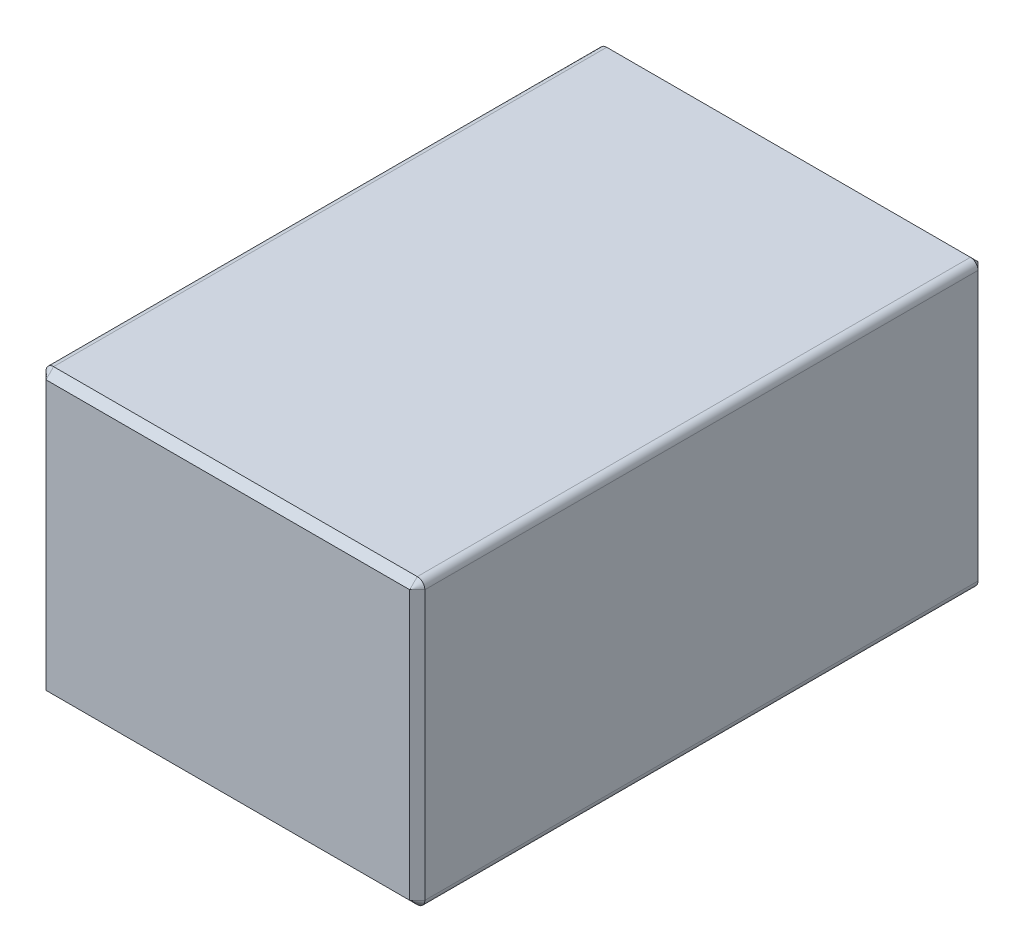
ISO-10303-21;
HEADER;
FILE_DESCRIPTION(('STEP AP214'),'2;1');
FILE_NAME('part.step','',(''),(''),'','','');
FILE_SCHEMA(('AUTOMOTIVE_DESIGN { 1 0 10303 214 1 1 1 1 }'));
ENDSEC;
DATA;
#1=APPLICATION_CONTEXT('core data for automotive mechanical design processes');
#2=APPLICATION_PROTOCOL_DEFINITION('international standard','automotive_design',2000,#1);
#3=PRODUCT_CONTEXT('',#1,'mechanical');
#4=PRODUCT('Part','Part','',(#3));
#5=PRODUCT_RELATED_PRODUCT_CATEGORY('part','',(#4));
#6=PRODUCT_DEFINITION_FORMATION('','',#4);
#7=PRODUCT_DEFINITION_CONTEXT('part definition',#1,'design');
#8=PRODUCT_DEFINITION('design','',#6,#7);
#9=PRODUCT_DEFINITION_SHAPE('','',#8);
#10=(LENGTH_UNIT() NAMED_UNIT(*) SI_UNIT(.MILLI.,.METRE.));
#11=(NAMED_UNIT(*) PLANE_ANGLE_UNIT() SI_UNIT($,.RADIAN.));
#12=(NAMED_UNIT(*) SI_UNIT($,.STERADIAN.) SOLID_ANGLE_UNIT());
#13=UNCERTAINTY_MEASURE_WITH_UNIT(LENGTH_MEASURE(1.E-05),#10,'distance_accuracy_value','');
#14=(GEOMETRIC_REPRESENTATION_CONTEXT(3) GLOBAL_UNCERTAINTY_ASSIGNED_CONTEXT((#13)) GLOBAL_UNIT_ASSIGNED_CONTEXT((#10,
#11,#12)) REPRESENTATION_CONTEXT('',''));
#15=CARTESIAN_POINT('',(0.,0.,0.));
#16=DIRECTION('',(0.,0.,1.));
#17=DIRECTION('',(1.,0.,0.));
#18=AXIS2_PLACEMENT_3D('',#15,#16,#17);
#19=CARTESIAN_POINT('',(50.,75.,-75.));
#20=DIRECTION('',(-1.,0.,0.));
#21=DIRECTION('',(0.,0.,1.));
#22=AXIS2_PLACEMENT_3D('',#19,#20,#21);
#23=PLANE('',#22);
#24=DIRECTION('',(0.,0.,-1.));
#25=VECTOR('',#24,1.);
#26=CARTESIAN_POINT('',(50.,2.,-75.));
#27=LINE('',#26,#25);
#28=CARTESIAN_POINT('',(50.,2.,73.));
#29=VERTEX_POINT('',#28);
#30=CARTESIAN_POINT('',(50.,2.,-73.));
#31=VERTEX_POINT('',#30);
#32=EDGE_CURVE('E251',#29,#31,#27,.T.);
#33=ORIENTED_EDGE('',*,*,#32,.T.);
#34=DIRECTION('',(0.,1.,0.));
#35=VECTOR('',#34,1.);
#36=CARTESIAN_POINT('',(50.,75.,-73.));
#37=LINE('',#36,#35);
#38=CARTESIAN_POINT('',(50.,73.,-73.));
#39=VERTEX_POINT('',#38);
#40=EDGE_CURVE('E233',#31,#39,#37,.T.);
#41=ORIENTED_EDGE('',*,*,#40,.T.);
#42=DIRECTION('',(0.,0.,-1.));
#43=VECTOR('',#42,1.);
#44=CARTESIAN_POINT('',(50.,73.,75.));
#45=LINE('',#44,#43);
#46=CARTESIAN_POINT('',(50.,73.,73.));
#47=VERTEX_POINT('',#46);
#48=EDGE_CURVE('E253',#39,#47,#45,.F.);
#49=ORIENTED_EDGE('',*,*,#48,.T.);
#50=DIRECTION('',(0.,-1.,0.));
#51=VECTOR('',#50,1.);
#52=CARTESIAN_POINT('',(50.,75.,73.));
#53=LINE('',#52,#51);
#54=EDGE_CURVE('E235',#47,#29,#53,.T.);
#55=ORIENTED_EDGE('',*,*,#54,.T.);
#56=EDGE_LOOP('',(#33,#41,#49,#55));
#57=FACE_BOUND('',#56,.T.);
#58=ADVANCED_FACE('F33',(#57),#23,.F.);
#59=CARTESIAN_POINT('',(-50.,75.,-75.));
#60=DIRECTION('',(0.,0.,1.));
#61=DIRECTION('',(1.,0.,0.));
#62=AXIS2_PLACEMENT_3D('',#59,#60,#61);
#63=PLANE('',#62);
#64=DIRECTION('',(1.,0.,0.));
#65=VECTOR('',#64,1.);
#66=CARTESIAN_POINT('',(48.,73.,-75.));
#67=LINE('',#66,#65);
#68=CARTESIAN_POINT('',(-48.,73.,-75.));
#69=VERTEX_POINT('',#68);
#70=CARTESIAN_POINT('',(48.,73.,-75.));
#71=VERTEX_POINT('',#70);
#72=EDGE_CURVE('E239',#69,#71,#67,.T.);
#73=ORIENTED_EDGE('',*,*,#72,.T.);
#74=DIRECTION('',(0.,-1.,0.));
#75=VECTOR('',#74,1.);
#76=CARTESIAN_POINT('',(48.,75.,-75.));
#77=LINE('',#76,#75);
#78=CARTESIAN_POINT('',(48.,2.00000000000003,-75.));
#79=VERTEX_POINT('',#78);
#80=EDGE_CURVE('E237',#71,#79,#77,.T.);
#81=ORIENTED_EDGE('',*,*,#80,.T.);
#82=DIRECTION('',(-1.,0.,0.));
#83=VECTOR('',#82,1.);
#84=CARTESIAN_POINT('',(-50.,2.00000000000003,-75.));
#85=LINE('',#84,#83);
#86=CARTESIAN_POINT('',(-48.,2.00000000000003,-75.));
#87=VERTEX_POINT('',#86);
#88=EDGE_CURVE('E154',#79,#87,#85,.T.);
#89=ORIENTED_EDGE('',*,*,#88,.T.);
#90=DIRECTION('',(0.,1.,0.));
#91=VECTOR('',#90,1.);
#92=CARTESIAN_POINT('',(-48.,75.,-75.));
#93=LINE('',#92,#91);
#94=EDGE_CURVE('E241',#87,#69,#93,.T.);
#95=ORIENTED_EDGE('',*,*,#94,.T.);
#96=EDGE_LOOP('',(#73,#81,#89,#95));
#97=FACE_BOUND('',#96,.T.);
#98=ADVANCED_FACE('F315',(#97),#63,.F.);
#99=CARTESIAN_POINT('',(-50.,75.,-75.));
#100=DIRECTION('',(1.,0.,0.));
#101=DIRECTION('',(0.,0.,-1.));
#102=AXIS2_PLACEMENT_3D('',#99,#100,#101);
#103=PLANE('',#102);
#104=DIRECTION('',(0.,0.,1.));
#105=VECTOR('',#104,1.);
#106=CARTESIAN_POINT('',(-50.,73.,-75.));
#107=LINE('',#106,#105);
#108=CARTESIAN_POINT('',(-50.,73.,73.));
#109=VERTEX_POINT('',#108);
#110=CARTESIAN_POINT('',(-50.,73.,-73.));
#111=VERTEX_POINT('',#110);
#112=EDGE_CURVE('E182',#109,#111,#107,.F.);
#113=ORIENTED_EDGE('',*,*,#112,.T.);
#114=DIRECTION('',(0.,-1.,0.));
#115=VECTOR('',#114,1.);
#116=CARTESIAN_POINT('',(-50.,75.,-73.));
#117=LINE('',#116,#115);
#118=CARTESIAN_POINT('',(-50.,2.,-73.));
#119=VERTEX_POINT('',#118);
#120=EDGE_CURVE('E216',#111,#119,#117,.T.);
#121=ORIENTED_EDGE('',*,*,#120,.T.);
#122=DIRECTION('',(0.,0.,1.));
#123=VECTOR('',#122,1.);
#124=CARTESIAN_POINT('',(-50.,2.,-75.));
#125=LINE('',#124,#123);
#126=CARTESIAN_POINT('',(-50.,2.,73.));
#127=VERTEX_POINT('',#126);
#128=EDGE_CURVE('E146',#119,#127,#125,.T.);
#129=ORIENTED_EDGE('',*,*,#128,.T.);
#130=DIRECTION('',(0.,1.,0.));
#131=VECTOR('',#130,1.);
#132=CARTESIAN_POINT('',(-50.,75.,73.));
#133=LINE('',#132,#131);
#134=EDGE_CURVE('E218',#127,#109,#133,.T.);
#135=ORIENTED_EDGE('',*,*,#134,.T.);
#136=EDGE_LOOP('',(#113,#121,#129,#135));
#137=FACE_BOUND('',#136,.T.);
#138=ADVANCED_FACE('F263',(#137),#103,.F.);
#139=CARTESIAN_POINT('',(-50.,75.,75.));
#140=DIRECTION('',(0.,0.,-1.));
#141=DIRECTION('',(-1.,0.,0.));
#142=AXIS2_PLACEMENT_3D('',#139,#140,#141);
#143=PLANE('',#142);
#144=DIRECTION('',(0.,1.,0.));
#145=VECTOR('',#144,1.);
#146=CARTESIAN_POINT('',(48.,75.,75.));
#147=LINE('',#146,#145);
#148=CARTESIAN_POINT('',(48.,2.00000000000003,75.));
#149=VERTEX_POINT('',#148);
#150=CARTESIAN_POINT('',(48.,73.,75.));
#151=VERTEX_POINT('',#150);
#152=EDGE_CURVE('E42',#149,#151,#147,.T.);
#153=ORIENTED_EDGE('',*,*,#152,.T.);
#154=DIRECTION('',(-1.,0.,0.));
#155=VECTOR('',#154,1.);
#156=CARTESIAN_POINT('',(-48.,73.,75.));
#157=LINE('',#156,#155);
#158=CARTESIAN_POINT('',(-48.,73.,75.));
#159=VERTEX_POINT('',#158);
#160=EDGE_CURVE('E11',#151,#159,#157,.T.);
#161=ORIENTED_EDGE('',*,*,#160,.T.);
#162=DIRECTION('',(0.,-1.,0.));
#163=VECTOR('',#162,1.);
#164=CARTESIAN_POINT('',(-48.,75.,75.));
#165=LINE('',#164,#163);
#166=CARTESIAN_POINT('',(-48.,2.,75.));
#167=VERTEX_POINT('',#166);
#168=EDGE_CURVE('E134',#159,#167,#165,.T.);
#169=ORIENTED_EDGE('',*,*,#168,.T.);
#170=DIRECTION('',(1.,0.,0.));
#171=VECTOR('',#170,1.);
#172=CARTESIAN_POINT('',(-50.,2.00000000000003,75.));
#173=LINE('',#172,#171);
#174=EDGE_CURVE('E53',#167,#149,#173,.T.);
#175=ORIENTED_EDGE('',*,*,#174,.T.);
#176=EDGE_LOOP('',(#153,#161,#169,#175));
#177=FACE_BOUND('',#176,.T.);
#178=ADVANCED_FACE('F322',(#177),#143,.F.);
#179=CARTESIAN_POINT('',(0.,75.,0.));
#180=DIRECTION('',(0.,1.,0.));
#181=DIRECTION('',(0.,0.,1.));
#182=AXIS2_PLACEMENT_3D('',#179,#180,#181);
#183=PLANE('',#182);
#184=DIRECTION('',(0.,0.,-1.));
#185=VECTOR('',#184,1.);
#186=CARTESIAN_POINT('',(48.,75.,-75.));
#187=LINE('',#186,#185);
#188=CARTESIAN_POINT('',(48.,75.,73.));
#189=VERTEX_POINT('',#188);
#190=CARTESIAN_POINT('',(48.,75.,-73.));
#191=VERTEX_POINT('',#190);
#192=EDGE_CURVE('E248',#189,#191,#187,.T.);
#193=ORIENTED_EDGE('',*,*,#192,.T.);
#194=DIRECTION('',(-1.,0.,0.));
#195=VECTOR('',#194,1.);
#196=CARTESIAN_POINT('',(-48.,75.,-73.));
#197=LINE('',#196,#195);
#198=CARTESIAN_POINT('',(-48.,75.,-73.));
#199=VERTEX_POINT('',#198);
#200=EDGE_CURVE('E225',#191,#199,#197,.T.);
#201=ORIENTED_EDGE('',*,*,#200,.T.);
#202=DIRECTION('',(0.,0.,1.));
#203=VECTOR('',#202,1.);
#204=CARTESIAN_POINT('',(-48.,75.,75.));
#205=LINE('',#204,#203);
#206=CARTESIAN_POINT('',(-48.,75.,73.));
#207=VERTEX_POINT('',#206);
#208=EDGE_CURVE('E245',#199,#207,#205,.T.);
#209=ORIENTED_EDGE('',*,*,#208,.T.);
#210=DIRECTION('',(1.,0.,0.));
#211=VECTOR('',#210,1.);
#212=CARTESIAN_POINT('',(48.,75.,73.));
#213=LINE('',#212,#211);
#214=EDGE_CURVE('E227',#207,#189,#213,.T.);
#215=ORIENTED_EDGE('',*,*,#214,.T.);
#216=EDGE_LOOP('',(#193,#201,#209,#215));
#217=FACE_BOUND('',#216,.T.);
#218=ADVANCED_FACE('F302',(#217),#183,.T.);
#219=CARTESIAN_POINT('',(0.,0.,0.));
#220=DIRECTION('',(0.,1.,0.));
#221=DIRECTION('',(0.,0.,1.));
#222=AXIS2_PLACEMENT_3D('',#219,#220,#221);
#223=PLANE('',#222);
#224=DIRECTION('',(0.,0.,1.));
#225=VECTOR('',#224,1.);
#226=CARTESIAN_POINT('',(-48.,0.,0.));
#227=LINE('',#226,#225);
#228=CARTESIAN_POINT('',(-48.,0.,73.));
#229=VERTEX_POINT('',#228);
#230=CARTESIAN_POINT('',(-48.,0.,-73.));
#231=VERTEX_POINT('',#230);
#232=EDGE_CURVE('E129',#229,#231,#227,.F.);
#233=ORIENTED_EDGE('',*,*,#232,.T.);
#234=DIRECTION('',(1.,0.,0.));
#235=VECTOR('',#234,1.);
#236=CARTESIAN_POINT('',(0.,0.,-73.));
#237=LINE('',#236,#235);
#238=CARTESIAN_POINT('',(48.,0.,-73.));
#239=VERTEX_POINT('',#238);
#240=EDGE_CURVE('E123',#231,#239,#237,.T.);
#241=ORIENTED_EDGE('',*,*,#240,.T.);
#242=DIRECTION('',(0.,0.,-1.));
#243=VECTOR('',#242,1.);
#244=CARTESIAN_POINT('',(48.,0.,0.));
#245=LINE('',#244,#243);
#246=CARTESIAN_POINT('',(48.,0.,73.));
#247=VERTEX_POINT('',#246);
#248=EDGE_CURVE('E126',#239,#247,#245,.F.);
#249=ORIENTED_EDGE('',*,*,#248,.T.);
#250=DIRECTION('',(-1.,0.,0.));
#251=VECTOR('',#250,1.);
#252=CARTESIAN_POINT('',(0.,0.,73.));
#253=LINE('',#252,#251);
#254=EDGE_CURVE('E135',#247,#229,#253,.T.);
#255=ORIENTED_EDGE('',*,*,#254,.T.);
#256=EDGE_LOOP('',(#233,#241,#249,#255));
#257=FACE_BOUND('',#256,.T.);
#258=ADVANCED_FACE('F125',(#257),#223,.F.);
#259=CARTESIAN_POINT('',(-48.,2.,-75.));
#260=DIRECTION('',(0.,0.,1.));
#261=DIRECTION('',(1.,0.,0.));
#262=AXIS2_PLACEMENT_3D('',#259,#260,#261);
#263=CYLINDRICAL_SURFACE('',#262,2.);
#264=ORIENTED_EDGE('',*,*,#128,.F.);
#265=CARTESIAN_POINT('',(-48.,2.,-73.));
#266=DIRECTION('',(0.,0.,1.));
#267=DIRECTION('',(1.,0.,0.));
#268=AXIS2_PLACEMENT_3D('',#265,#266,#267);
#269=CIRCLE('',#268,2.);
#270=EDGE_CURVE('E212',#119,#231,#269,.T.);
#271=ORIENTED_EDGE('',*,*,#270,.T.);
#272=ORIENTED_EDGE('',*,*,#232,.F.);
#273=CARTESIAN_POINT('',(-48.,2.,73.));
#274=DIRECTION('',(0.,0.,-1.));
#275=DIRECTION('',(-1.,0.,0.));
#276=AXIS2_PLACEMENT_3D('',#273,#274,#275);
#277=CIRCLE('',#276,2.);
#278=EDGE_CURVE('E214',#229,#127,#277,.T.);
#279=ORIENTED_EDGE('',*,*,#278,.T.);
#280=EDGE_LOOP('',(#264,#271,#272,#279));
#281=FACE_BOUND('',#280,.T.);
#282=ADVANCED_FACE('F282',(#281),#263,.T.);
#283=CARTESIAN_POINT('',(48.,2.,-75.));
#284=DIRECTION('',(0.,0.,-1.));
#285=DIRECTION('',(-1.,0.,0.));
#286=AXIS2_PLACEMENT_3D('',#283,#284,#285);
#287=CYLINDRICAL_SURFACE('',#286,2.);
#288=ORIENTED_EDGE('',*,*,#248,.F.);
#289=CARTESIAN_POINT('',(48.,2.,-73.));
#290=DIRECTION('',(0.,0.,1.));
#291=DIRECTION('',(1.,0.,0.));
#292=AXIS2_PLACEMENT_3D('',#289,#290,#291);
#293=CIRCLE('',#292,2.);
#294=EDGE_CURVE('E142',#239,#31,#293,.T.);
#295=ORIENTED_EDGE('',*,*,#294,.T.);
#296=ORIENTED_EDGE('',*,*,#32,.F.);
#297=CARTESIAN_POINT('',(48.,2.,73.));
#298=DIRECTION('',(0.,0.,-1.));
#299=DIRECTION('',(-1.,0.,0.));
#300=AXIS2_PLACEMENT_3D('',#297,#298,#299);
#301=CIRCLE('',#300,2.);
#302=EDGE_CURVE('E145',#29,#247,#301,.T.);
#303=ORIENTED_EDGE('',*,*,#302,.T.);
#304=EDGE_LOOP('',(#288,#295,#296,#303));
#305=FACE_BOUND('',#304,.T.);
#306=ADVANCED_FACE('F140',(#305),#287,.T.);
#307=CARTESIAN_POINT('',(-48.,73.,0.));
#308=DIRECTION('',(0.,0.,-1.));
#309=DIRECTION('',(-1.,0.,0.));
#310=AXIS2_PLACEMENT_3D('',#307,#308,#309);
#311=CYLINDRICAL_SURFACE('',#310,2.);
#312=ORIENTED_EDGE('',*,*,#208,.F.);
#313=CARTESIAN_POINT('',(-48.,73.,-73.));
#314=DIRECTION('',(0.,0.,1.));
#315=DIRECTION('',(1.,0.,0.));
#316=AXIS2_PLACEMENT_3D('',#313,#314,#315);
#317=CIRCLE('',#316,2.);
#318=EDGE_CURVE('E220',#199,#111,#317,.T.);
#319=ORIENTED_EDGE('',*,*,#318,.T.);
#320=ORIENTED_EDGE('',*,*,#112,.F.);
#321=CARTESIAN_POINT('',(-48.,73.,73.));
#322=DIRECTION('',(0.,0.,-1.));
#323=DIRECTION('',(-1.,0.,0.));
#324=AXIS2_PLACEMENT_3D('',#321,#322,#323);
#325=CIRCLE('',#324,2.);
#326=EDGE_CURVE('E222',#109,#207,#325,.T.);
#327=ORIENTED_EDGE('',*,*,#326,.T.);
#328=EDGE_LOOP('',(#312,#319,#320,#327));
#329=FACE_BOUND('',#328,.T.);
#330=ADVANCED_FACE('F301',(#329),#311,.T.);
#331=CARTESIAN_POINT('',(48.,73.,0.));
#332=DIRECTION('',(0.,0.,1.));
#333=DIRECTION('',(1.,0.,0.));
#334=AXIS2_PLACEMENT_3D('',#331,#332,#333);
#335=CYLINDRICAL_SURFACE('',#334,2.);
#336=ORIENTED_EDGE('',*,*,#48,.F.);
#337=CARTESIAN_POINT('',(48.,73.,-73.));
#338=DIRECTION('',(0.,0.,1.));
#339=DIRECTION('',(1.,0.,0.));
#340=AXIS2_PLACEMENT_3D('',#337,#338,#339);
#341=CIRCLE('',#340,2.);
#342=EDGE_CURVE('E229',#39,#191,#341,.T.);
#343=ORIENTED_EDGE('',*,*,#342,.T.);
#344=ORIENTED_EDGE('',*,*,#192,.F.);
#345=CARTESIAN_POINT('',(48.,73.,73.));
#346=DIRECTION('',(0.,0.,-1.));
#347=DIRECTION('',(-1.,0.,0.));
#348=AXIS2_PLACEMENT_3D('',#345,#346,#347);
#349=CIRCLE('',#348,2.);
#350=EDGE_CURVE('E231',#189,#47,#349,.T.);
#351=ORIENTED_EDGE('',*,*,#350,.T.);
#352=EDGE_LOOP('',(#336,#343,#344,#351));
#353=FACE_BOUND('',#352,.T.);
#354=ADVANCED_FACE('F334',(#353),#335,.T.);
#355=CARTESIAN_POINT('',(-48.,73.,-73.));
#356=DIRECTION('',(0.,0.,1.));
#357=DIRECTION('',(1.,0.,0.));
#358=AXIS2_PLACEMENT_3D('',#355,#356,#357);
#359=CONICAL_SURFACE('',#358,2.00000000000003,0.785398163397448);
#360=DIRECTION('',(0.707106781186547,0.,-0.707106781186547));
#361=VECTOR('',#360,1.);
#362=CARTESIAN_POINT('',(-50.,73.,-73.));
#363=LINE('',#362,#361);
#364=EDGE_CURVE('E176',#111,#69,#363,.T.);
#365=ORIENTED_EDGE('',*,*,#364,.F.);
#366=ORIENTED_EDGE('',*,*,#318,.F.);
#367=DIRECTION('',(0.,0.707106781186547,0.707106781186547));
#368=VECTOR('',#367,1.);
#369=CARTESIAN_POINT('',(-48.,73.,-75.));
#370=LINE('',#369,#368);
#371=EDGE_CURVE('E179',#69,#199,#370,.T.);
#372=ORIENTED_EDGE('',*,*,#371,.F.);
#373=EDGE_LOOP('',(#365,#366,#372));
#374=FACE_BOUND('',#373,.T.);
#375=ADVANCED_FACE('F272',(#374),#359,.T.);
#376=CARTESIAN_POINT('',(0.,75.,-73.));
#377=DIRECTION('',(0.,0.707106781186547,-0.707106781186547));
#378=DIRECTION('',(1.,0.,0.));
#379=AXIS2_PLACEMENT_3D('',#376,#377,#378);
#380=PLANE('',#379);
#381=ORIENTED_EDGE('',*,*,#371,.T.);
#382=ORIENTED_EDGE('',*,*,#200,.F.);
#383=DIRECTION('',(0.,0.707106781186547,0.707106781186547));
#384=VECTOR('',#383,1.);
#385=CARTESIAN_POINT('',(48.,73.,-75.));
#386=LINE('',#385,#384);
#387=EDGE_CURVE('E173',#71,#191,#386,.T.);
#388=ORIENTED_EDGE('',*,*,#387,.F.);
#389=ORIENTED_EDGE('',*,*,#72,.F.);
#390=EDGE_LOOP('',(#381,#382,#388,#389));
#391=FACE_BOUND('',#390,.T.);
#392=ADVANCED_FACE('F306',(#391),#380,.T.);
#393=CARTESIAN_POINT('',(-50.,75.,-73.));
#394=DIRECTION('',(0.707106781186547,0.,0.707106781186547));
#395=DIRECTION('',(0.,-1.,0.));
#396=AXIS2_PLACEMENT_3D('',#393,#394,#395);
#397=PLANE('',#396);
#398=ORIENTED_EDGE('',*,*,#364,.T.);
#399=ORIENTED_EDGE('',*,*,#94,.F.);
#400=DIRECTION('',(0.707106781186547,0.,-0.707106781186547));
#401=VECTOR('',#400,1.);
#402=CARTESIAN_POINT('',(-50.,2.,-73.));
#403=LINE('',#402,#401);
#404=EDGE_CURVE('E170',#119,#87,#403,.T.);
#405=ORIENTED_EDGE('',*,*,#404,.F.);
#406=ORIENTED_EDGE('',*,*,#120,.F.);
#407=EDGE_LOOP('',(#398,#399,#405,#406));
#408=FACE_BOUND('',#407,.T.);
#409=ADVANCED_FACE('F277',(#408),#397,.F.);
#410=CARTESIAN_POINT('',(48.,73.,-73.));
#411=DIRECTION('',(0.,0.,1.));
#412=DIRECTION('',(1.,0.,0.));
#413=AXIS2_PLACEMENT_3D('',#410,#411,#412);
#414=CONICAL_SURFACE('',#413,2.00000000000003,0.785398163397448);
#415=ORIENTED_EDGE('',*,*,#387,.T.);
#416=ORIENTED_EDGE('',*,*,#342,.F.);
#417=DIRECTION('',(0.707106781186546,0.,0.707106781186549));
#418=VECTOR('',#417,1.);
#419=CARTESIAN_POINT('',(48.,73.,-75.));
#420=LINE('',#419,#418);
#421=EDGE_CURVE('E167',#71,#39,#420,.T.);
#422=ORIENTED_EDGE('',*,*,#421,.F.);
#423=EDGE_LOOP('',(#415,#416,#422));
#424=FACE_BOUND('',#423,.T.);
#425=ADVANCED_FACE('F310',(#424),#414,.T.);
#426=CARTESIAN_POINT('',(-48.,2.,-73.));
#427=DIRECTION('',(0.,0.,1.));
#428=DIRECTION('',(1.,0.,0.));
#429=AXIS2_PLACEMENT_3D('',#426,#427,#428);
#430=CONICAL_SURFACE('',#429,2.00000000000003,0.785398163397448);
#431=ORIENTED_EDGE('',*,*,#270,.F.);
#432=ORIENTED_EDGE('',*,*,#404,.T.);
#433=DIRECTION('',(0.,0.707106781186547,-0.707106781186548));
#434=VECTOR('',#433,1.);
#435=CARTESIAN_POINT('',(-48.,0.,-73.));
#436=LINE('',#435,#434);
#437=EDGE_CURVE('E160',#231,#87,#436,.T.);
#438=ORIENTED_EDGE('',*,*,#437,.F.);
#439=EDGE_LOOP('',(#431,#432,#438));
#440=FACE_BOUND('',#439,.T.);
#441=ADVANCED_FACE('F280',(#440),#430,.T.);
#442=CARTESIAN_POINT('',(48.,75.,-75.));
#443=DIRECTION('',(-0.707106781186547,0.,0.707106781186547));
#444=DIRECTION('',(0.,-1.,0.));
#445=AXIS2_PLACEMENT_3D('',#442,#443,#444);
#446=PLANE('',#445);
#447=ORIENTED_EDGE('',*,*,#421,.T.);
#448=ORIENTED_EDGE('',*,*,#40,.F.);
#449=DIRECTION('',(0.707106781186547,0.,0.707106781186547));
#450=VECTOR('',#449,1.);
#451=CARTESIAN_POINT('',(48.,2.,-75.));
#452=LINE('',#451,#450);
#453=EDGE_CURVE('E152',#79,#31,#452,.T.);
#454=ORIENTED_EDGE('',*,*,#453,.F.);
#455=ORIENTED_EDGE('',*,*,#80,.F.);
#456=EDGE_LOOP('',(#447,#448,#454,#455));
#457=FACE_BOUND('',#456,.T.);
#458=ADVANCED_FACE('F313',(#457),#446,.F.);
#459=CARTESIAN_POINT('',(-50.,2.00000000000003,-75.));
#460=DIRECTION('',(0.,0.707106781186547,0.707106781186547));
#461=DIRECTION('',(-1.,0.,0.));
#462=AXIS2_PLACEMENT_3D('',#459,#460,#461);
#463=PLANE('',#462);
#464=ORIENTED_EDGE('',*,*,#437,.T.);
#465=ORIENTED_EDGE('',*,*,#88,.F.);
#466=DIRECTION('',(0.,0.707106781186547,-0.707106781186547));
#467=VECTOR('',#466,1.);
#468=CARTESIAN_POINT('',(48.,0.,-73.));
#469=LINE('',#468,#467);
#470=EDGE_CURVE('E150',#239,#79,#469,.T.);
#471=ORIENTED_EDGE('',*,*,#470,.F.);
#472=ORIENTED_EDGE('',*,*,#240,.F.);
#473=EDGE_LOOP('',(#464,#465,#471,#472));
#474=FACE_BOUND('',#473,.T.);
#475=ADVANCED_FACE('F157',(#474),#463,.F.);
#476=CARTESIAN_POINT('',(48.,2.,-73.));
#477=DIRECTION('',(0.,0.,1.));
#478=DIRECTION('',(1.,0.,0.));
#479=AXIS2_PLACEMENT_3D('',#476,#477,#478);
#480=CONICAL_SURFACE('',#479,2.00000000000003,0.785398163397448);
#481=ORIENTED_EDGE('',*,*,#453,.T.);
#482=ORIENTED_EDGE('',*,*,#294,.F.);
#483=ORIENTED_EDGE('',*,*,#470,.T.);
#484=EDGE_LOOP('',(#481,#482,#483));
#485=FACE_BOUND('',#484,.T.);
#486=ADVANCED_FACE('F149',(#485),#480,.T.);
#487=CARTESIAN_POINT('',(48.,2.,73.));
#488=DIRECTION('',(0.,0.,-1.));
#489=DIRECTION('',(-1.,0.,0.));
#490=AXIS2_PLACEMENT_3D('',#487,#488,#489);
#491=CONICAL_SURFACE('',#490,2.00000000000003,0.785398163397448);
#492=DIRECTION('',(0.,0.707106781186547,0.707106781186548));
#493=VECTOR('',#492,1.);
#494=CARTESIAN_POINT('',(48.,0.,73.));
#495=LINE('',#494,#493);
#496=EDGE_CURVE('E163',#247,#149,#495,.T.);
#497=ORIENTED_EDGE('',*,*,#496,.F.);
#498=ORIENTED_EDGE('',*,*,#302,.F.);
#499=DIRECTION('',(0.707106781186549,0.,-0.707106781186546));
#500=VECTOR('',#499,1.);
#501=CARTESIAN_POINT('',(48.,2.,75.));
#502=LINE('',#501,#500);
#503=EDGE_CURVE('E37',#149,#29,#502,.T.);
#504=ORIENTED_EDGE('',*,*,#503,.F.);
#505=EDGE_LOOP('',(#497,#498,#504));
#506=FACE_BOUND('',#505,.T.);
#507=ADVANCED_FACE('F35',(#506),#491,.T.);
#508=CARTESIAN_POINT('',(50.,75.,73.));
#509=DIRECTION('',(-0.707106781186546,0.,-0.707106781186549));
#510=DIRECTION('',(0.,-1.,0.));
#511=AXIS2_PLACEMENT_3D('',#508,#509,#510);
#512=PLANE('',#511);
#513=ORIENTED_EDGE('',*,*,#503,.T.);
#514=ORIENTED_EDGE('',*,*,#54,.F.);
#515=DIRECTION('',(0.707106781186549,0.,-0.707106781186546));
#516=VECTOR('',#515,1.);
#517=CARTESIAN_POINT('',(48.,73.,75.));
#518=LINE('',#517,#516);
#519=EDGE_CURVE('E196',#151,#47,#518,.T.);
#520=ORIENTED_EDGE('',*,*,#519,.F.);
#521=ORIENTED_EDGE('',*,*,#152,.F.);
#522=EDGE_LOOP('',(#513,#514,#520,#521));
#523=FACE_BOUND('',#522,.T.);
#524=ADVANCED_FACE('F206',(#523),#512,.F.);
#525=CARTESIAN_POINT('',(-50.,2.00000000000003,75.));
#526=DIRECTION('',(0.,0.707106781186547,-0.707106781186547));
#527=DIRECTION('',(1.,0.,0.));
#528=AXIS2_PLACEMENT_3D('',#525,#526,#527);
#529=PLANE('',#528);
#530=ORIENTED_EDGE('',*,*,#496,.T.);
#531=ORIENTED_EDGE('',*,*,#174,.F.);
#532=DIRECTION('',(0.,0.707106781186547,0.707106781186547));
#533=VECTOR('',#532,1.);
#534=CARTESIAN_POINT('',(-48.,0.,73.));
#535=LINE('',#534,#533);
#536=EDGE_CURVE('E193',#229,#167,#535,.T.);
#537=ORIENTED_EDGE('',*,*,#536,.F.);
#538=ORIENTED_EDGE('',*,*,#254,.F.);
#539=EDGE_LOOP('',(#530,#531,#537,#538));
#540=FACE_BOUND('',#539,.T.);
#541=ADVANCED_FACE('F201',(#540),#529,.F.);
#542=CARTESIAN_POINT('',(48.,73.,73.));
#543=DIRECTION('',(0.,0.,-1.));
#544=DIRECTION('',(-1.,0.,0.));
#545=AXIS2_PLACEMENT_3D('',#542,#543,#544);
#546=CONICAL_SURFACE('',#545,2.00000000000003,0.785398163397448);
#547=ORIENTED_EDGE('',*,*,#519,.T.);
#548=ORIENTED_EDGE('',*,*,#350,.F.);
#549=DIRECTION('',(0.,0.707106781186547,-0.707106781186547));
#550=VECTOR('',#549,1.);
#551=CARTESIAN_POINT('',(48.,73.,75.));
#552=LINE('',#551,#550);
#553=EDGE_CURVE('E190',#151,#189,#552,.T.);
#554=ORIENTED_EDGE('',*,*,#553,.F.);
#555=EDGE_LOOP('',(#547,#548,#554));
#556=FACE_BOUND('',#555,.T.);
#557=ADVANCED_FACE('F362',(#556),#546,.T.);
#558=CARTESIAN_POINT('',(-48.,2.,73.));
#559=DIRECTION('',(0.,0.,-1.));
#560=DIRECTION('',(-1.,0.,0.));
#561=AXIS2_PLACEMENT_3D('',#558,#559,#560);
#562=CONICAL_SURFACE('',#561,2.00000000000003,0.785398163397448);
#563=ORIENTED_EDGE('',*,*,#278,.F.);
#564=ORIENTED_EDGE('',*,*,#536,.T.);
#565=DIRECTION('',(0.707106781186547,0.,0.707106781186547));
#566=VECTOR('',#565,1.);
#567=CARTESIAN_POINT('',(-50.,2.,73.));
#568=LINE('',#567,#566);
#569=EDGE_CURVE('E187',#127,#167,#568,.T.);
#570=ORIENTED_EDGE('',*,*,#569,.F.);
#571=EDGE_LOOP('',(#563,#564,#570));
#572=FACE_BOUND('',#571,.T.);
#573=ADVANCED_FACE('F286',(#572),#562,.T.);
#574=CARTESIAN_POINT('',(0.,75.,73.));
#575=DIRECTION('',(0.,0.707106781186547,0.707106781186547));
#576=DIRECTION('',(-1.,0.,0.));
#577=AXIS2_PLACEMENT_3D('',#574,#575,#576);
#578=PLANE('',#577);
#579=ORIENTED_EDGE('',*,*,#553,.T.);
#580=ORIENTED_EDGE('',*,*,#214,.F.);
#581=DIRECTION('',(0.,0.707106781186547,-0.707106781186547));
#582=VECTOR('',#581,1.);
#583=CARTESIAN_POINT('',(-48.,73.,75.));
#584=LINE('',#583,#582);
#585=EDGE_CURVE('E185',#159,#207,#584,.T.);
#586=ORIENTED_EDGE('',*,*,#585,.F.);
#587=ORIENTED_EDGE('',*,*,#160,.F.);
#588=EDGE_LOOP('',(#579,#580,#586,#587));
#589=FACE_BOUND('',#588,.T.);
#590=ADVANCED_FACE('F297',(#589),#578,.T.);
#591=CARTESIAN_POINT('',(-48.,75.,75.));
#592=DIRECTION('',(0.707106781186547,0.,-0.707106781186547));
#593=DIRECTION('',(0.,-1.,0.));
#594=AXIS2_PLACEMENT_3D('',#591,#592,#593);
#595=PLANE('',#594);
#596=ORIENTED_EDGE('',*,*,#569,.T.);
#597=ORIENTED_EDGE('',*,*,#168,.F.);
#598=DIRECTION('',(0.707106781186547,0.,0.707106781186547));
#599=VECTOR('',#598,1.);
#600=CARTESIAN_POINT('',(-50.,73.,73.));
#601=LINE('',#600,#599);
#602=EDGE_CURVE('E183',#109,#159,#601,.T.);
#603=ORIENTED_EDGE('',*,*,#602,.F.);
#604=ORIENTED_EDGE('',*,*,#134,.F.);
#605=EDGE_LOOP('',(#596,#597,#603,#604));
#606=FACE_BOUND('',#605,.T.);
#607=ADVANCED_FACE('F290',(#606),#595,.F.);
#608=CARTESIAN_POINT('',(-48.,73.,73.));
#609=DIRECTION('',(0.,0.,-1.));
#610=DIRECTION('',(-1.,0.,0.));
#611=AXIS2_PLACEMENT_3D('',#608,#609,#610);
#612=CONICAL_SURFACE('',#611,2.00000000000003,0.785398163397448);
#613=ORIENTED_EDGE('',*,*,#585,.T.);
#614=ORIENTED_EDGE('',*,*,#326,.F.);
#615=ORIENTED_EDGE('',*,*,#602,.T.);
#616=EDGE_LOOP('',(#613,#614,#615));
#617=FACE_BOUND('',#616,.T.);
#618=ADVANCED_FACE('F293',(#617),#612,.T.);
#619=CLOSED_SHELL('',(#58,#98,#138,#178,#218,#258,#282,#306,#330,#354,#375,#392,#409,#425,#441,
#458,#475,#486,#507,#524,#541,#557,#573,#590,#607,#618));
#620=MANIFOLD_SOLID_BREP('B2',#619);
#621=ADVANCED_BREP_SHAPE_REPRESENTATION('',(#18,#620),#14);
#622=SHAPE_DEFINITION_REPRESENTATION(#9,#621);
ENDSEC;
END-ISO-10303-21;
